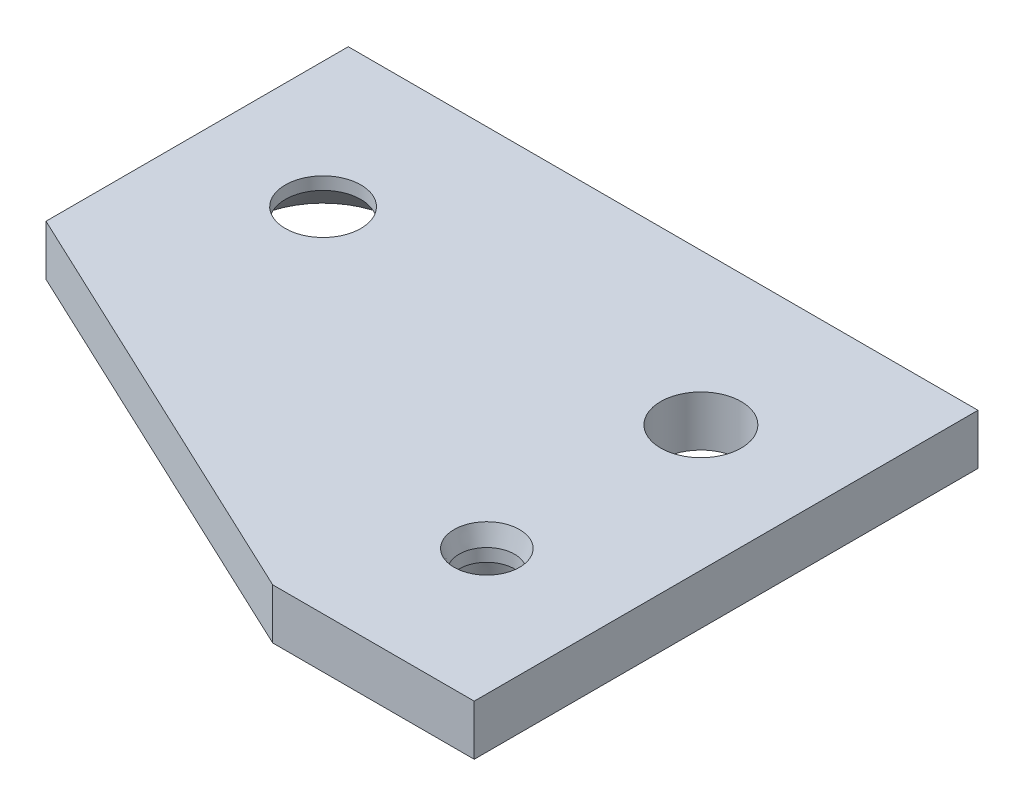
ISO-10303-21;
HEADER;
FILE_DESCRIPTION(('STEP AP214'),'2;1');
FILE_NAME('part.step','',(''),(''),'','','');
FILE_SCHEMA(('AUTOMOTIVE_DESIGN { 1 0 10303 214 1 1 1 1 }'));
ENDSEC;
DATA;
#1=APPLICATION_CONTEXT('core data for automotive mechanical design processes');
#2=APPLICATION_PROTOCOL_DEFINITION('international standard','automotive_design',2000,#1);
#3=PRODUCT_CONTEXT('',#1,'mechanical');
#4=PRODUCT('Part','Part','',(#3));
#5=PRODUCT_RELATED_PRODUCT_CATEGORY('part','',(#4));
#6=PRODUCT_DEFINITION_FORMATION('','',#4);
#7=PRODUCT_DEFINITION_CONTEXT('part definition',#1,'design');
#8=PRODUCT_DEFINITION('design','',#6,#7);
#9=PRODUCT_DEFINITION_SHAPE('','',#8);
#10=(LENGTH_UNIT() NAMED_UNIT(*) SI_UNIT(.MILLI.,.METRE.));
#11=(NAMED_UNIT(*) PLANE_ANGLE_UNIT() SI_UNIT($,.RADIAN.));
#12=(NAMED_UNIT(*) SI_UNIT($,.STERADIAN.) SOLID_ANGLE_UNIT());
#13=UNCERTAINTY_MEASURE_WITH_UNIT(LENGTH_MEASURE(1.E-05),#10,'distance_accuracy_value','');
#14=(GEOMETRIC_REPRESENTATION_CONTEXT(3) GLOBAL_UNCERTAINTY_ASSIGNED_CONTEXT((#13)) GLOBAL_UNIT_ASSIGNED_CONTEXT((#10,
#11,#12)) REPRESENTATION_CONTEXT('',''));
#15=CARTESIAN_POINT('',(0.,0.,0.));
#16=DIRECTION('',(0.,0.,1.));
#17=DIRECTION('',(1.,0.,0.));
#18=AXIS2_PLACEMENT_3D('',#15,#16,#17);
#19=CARTESIAN_POINT('',(-20.,2.,14.));
#20=DIRECTION('',(0.,1.,0.));
#21=DIRECTION('',(0.,0.,1.));
#22=AXIS2_PLACEMENT_3D('',#19,#20,#21);
#23=PLANE('',#22);
#24=CARTESIAN_POINT('',(0.,2.,8.5));
#25=DIRECTION('',(0.,1.,0.));
#26=DIRECTION('',(0.,0.,1.));
#27=AXIS2_PLACEMENT_3D('',#24,#25,#26);
#28=CIRCLE('',#27,1.30000000000001);
#29=CARTESIAN_POINT('',(0.,2.,9.80000000000001));
#30=VERTEX_POINT('',#29);
#31=EDGE_CURVE('E11',#30,#30,#28,.F.);
#32=ORIENTED_EDGE('',*,*,#31,.T.);
#33=EDGE_LOOP('',(#32));
#34=FACE_BOUND('',#33,.T.);
#35=CARTESIAN_POINT('',(-15.,2.,0.));
#36=DIRECTION('',(0.,1.,0.));
#37=DIRECTION('',(0.,0.,1.));
#38=AXIS2_PLACEMENT_3D('',#35,#36,#37);
#39=CIRCLE('',#38,1.5);
#40=CARTESIAN_POINT('',(-15.,2.,1.5));
#41=VERTEX_POINT('',#40);
#42=EDGE_CURVE('E275',#41,#41,#39,.T.);
#43=ORIENTED_EDGE('',*,*,#42,.F.);
#44=EDGE_LOOP('',(#43));
#45=FACE_BOUND('',#44,.T.);
#46=DIRECTION('',(0.,0.,1.));
#47=VECTOR('',#46,1.);
#48=CARTESIAN_POINT('',(-20.,2.,-6.));
#49=LINE('',#48,#47);
#50=CARTESIAN_POINT('',(-20.,2.,-6.));
#51=VERTEX_POINT('',#50);
#52=CARTESIAN_POINT('',(-20.,2.,6.));
#53=VERTEX_POINT('',#52);
#54=EDGE_CURVE('E113',#51,#53,#49,.T.);
#55=ORIENTED_EDGE('',*,*,#54,.T.);
#56=DIRECTION('',(0.904818702200994,0.,0.425797036329879));
#57=VECTOR('',#56,1.);
#58=CARTESIAN_POINT('',(-3.,2.,14.));
#59=LINE('',#58,#57);
#60=CARTESIAN_POINT('',(-3.,2.,14.));
#61=VERTEX_POINT('',#60);
#62=EDGE_CURVE('E93',#53,#61,#59,.T.);
#63=ORIENTED_EDGE('',*,*,#62,.T.);
#64=DIRECTION('',(1.,0.,0.));
#65=VECTOR('',#64,1.);
#66=CARTESIAN_POINT('',(-3.,2.,14.));
#67=LINE('',#66,#65);
#68=CARTESIAN_POINT('',(5.,2.,14.));
#69=VERTEX_POINT('',#68);
#70=EDGE_CURVE('E116',#61,#69,#67,.T.);
#71=ORIENTED_EDGE('',*,*,#70,.T.);
#72=DIRECTION('',(0.,0.,-1.));
#73=VECTOR('',#72,1.);
#74=CARTESIAN_POINT('',(5.,2.,-6.));
#75=LINE('',#74,#73);
#76=CARTESIAN_POINT('',(5.,2.,-6.));
#77=VERTEX_POINT('',#76);
#78=EDGE_CURVE('E50',#69,#77,#75,.T.);
#79=ORIENTED_EDGE('',*,*,#78,.T.);
#80=DIRECTION('',(-1.,0.,0.));
#81=VECTOR('',#80,1.);
#82=CARTESIAN_POINT('',(-20.,2.,-6.));
#83=LINE('',#82,#81);
#84=EDGE_CURVE('E45',#77,#51,#83,.T.);
#85=ORIENTED_EDGE('',*,*,#84,.T.);
#86=EDGE_LOOP('',(#55,#63,#71,#79,#85));
#87=FACE_BOUND('',#86,.T.);
#88=CARTESIAN_POINT('',(0.,2.,0.));
#89=DIRECTION('',(0.,1.,0.));
#90=DIRECTION('',(0.,0.,1.));
#91=AXIS2_PLACEMENT_3D('',#88,#89,#90);
#92=CIRCLE('',#91,1.6);
#93=CARTESIAN_POINT('',(0.,2.,1.6));
#94=VERTEX_POINT('',#93);
#95=EDGE_CURVE('E101',#94,#94,#92,.T.);
#96=ORIENTED_EDGE('',*,*,#95,.F.);
#97=EDGE_LOOP('',(#96));
#98=FACE_BOUND('',#97,.T.);
#99=ADVANCED_FACE('F30',(#34,#45,#87,#98),#23,.T.);
#100=CARTESIAN_POINT('',(-20.,0.,14.));
#101=DIRECTION('',(0.,1.,0.));
#102=DIRECTION('',(0.,0.,1.));
#103=AXIS2_PLACEMENT_3D('',#100,#101,#102);
#104=PLANE('',#103);
#105=CARTESIAN_POINT('',(0.,0.,8.5));
#106=DIRECTION('',(0.,1.,0.));
#107=DIRECTION('',(0.,0.,1.));
#108=AXIS2_PLACEMENT_3D('',#105,#106,#107);
#109=CIRCLE('',#108,1.3);
#110=CARTESIAN_POINT('',(0.,0.,9.8));
#111=VERTEX_POINT('',#110);
#112=EDGE_CURVE('E133',#111,#111,#109,.T.);
#113=ORIENTED_EDGE('',*,*,#112,.T.);
#114=EDGE_LOOP('',(#113));
#115=FACE_BOUND('',#114,.T.);
#116=CARTESIAN_POINT('',(-15.,0.,0.));
#117=DIRECTION('',(0.,1.,0.));
#118=DIRECTION('',(0.,0.,1.));
#119=AXIS2_PLACEMENT_3D('',#116,#117,#118);
#120=CIRCLE('',#119,3.);
#121=CARTESIAN_POINT('',(-15.,0.,3.));
#122=VERTEX_POINT('',#121);
#123=EDGE_CURVE('E96',#122,#122,#120,.T.);
#124=ORIENTED_EDGE('',*,*,#123,.T.);
#125=EDGE_LOOP('',(#124));
#126=FACE_BOUND('',#125,.T.);
#127=DIRECTION('',(0.,0.,1.));
#128=VECTOR('',#127,1.);
#129=CARTESIAN_POINT('',(-20.,0.,-6.));
#130=LINE('',#129,#128);
#131=CARTESIAN_POINT('',(-20.,0.,-6.));
#132=VERTEX_POINT('',#131);
#133=CARTESIAN_POINT('',(-20.,0.,6.));
#134=VERTEX_POINT('',#133);
#135=EDGE_CURVE('E83',#132,#134,#130,.T.);
#136=ORIENTED_EDGE('',*,*,#135,.F.);
#137=DIRECTION('',(-1.,0.,0.));
#138=VECTOR('',#137,1.);
#139=CARTESIAN_POINT('',(-20.,0.,-6.));
#140=LINE('',#139,#138);
#141=CARTESIAN_POINT('',(5.,0.,-6.));
#142=VERTEX_POINT('',#141);
#143=EDGE_CURVE('E111',#142,#132,#140,.T.);
#144=ORIENTED_EDGE('',*,*,#143,.F.);
#145=DIRECTION('',(0.,0.,-1.));
#146=VECTOR('',#145,1.);
#147=CARTESIAN_POINT('',(5.,0.,-6.));
#148=LINE('',#147,#146);
#149=CARTESIAN_POINT('',(5.,0.,14.));
#150=VERTEX_POINT('',#149);
#151=EDGE_CURVE('E109',#150,#142,#148,.T.);
#152=ORIENTED_EDGE('',*,*,#151,.F.);
#153=DIRECTION('',(1.,0.,0.));
#154=VECTOR('',#153,1.);
#155=CARTESIAN_POINT('',(-3.,0.,14.));
#156=LINE('',#155,#154);
#157=CARTESIAN_POINT('',(-3.,0.,14.));
#158=VERTEX_POINT('',#157);
#159=EDGE_CURVE('E85',#158,#150,#156,.T.);
#160=ORIENTED_EDGE('',*,*,#159,.F.);
#161=DIRECTION('',(0.904818702200994,0.,0.425797036329879));
#162=VECTOR('',#161,1.);
#163=CARTESIAN_POINT('',(-3.,0.,14.));
#164=LINE('',#163,#162);
#165=EDGE_CURVE('E77',#134,#158,#164,.T.);
#166=ORIENTED_EDGE('',*,*,#165,.F.);
#167=EDGE_LOOP('',(#136,#144,#152,#160,#166));
#168=FACE_BOUND('',#167,.T.);
#169=CARTESIAN_POINT('',(0.,0.,0.));
#170=DIRECTION('',(0.,1.,0.));
#171=DIRECTION('',(0.,0.,1.));
#172=AXIS2_PLACEMENT_3D('',#169,#170,#171);
#173=CIRCLE('',#172,1.6);
#174=CARTESIAN_POINT('',(0.,0.,1.6));
#175=VERTEX_POINT('',#174);
#176=EDGE_CURVE('E104',#175,#175,#173,.T.);
#177=ORIENTED_EDGE('',*,*,#176,.T.);
#178=EDGE_LOOP('',(#177));
#179=FACE_BOUND('',#178,.T.);
#180=ADVANCED_FACE('F79',(#115,#126,#168,#179),#104,.F.);
#181=CARTESIAN_POINT('',(-20.,2.,-6.));
#182=DIRECTION('',(1.,0.,0.));
#183=DIRECTION('',(0.,0.,-1.));
#184=AXIS2_PLACEMENT_3D('',#181,#182,#183);
#185=PLANE('',#184);
#186=ORIENTED_EDGE('',*,*,#135,.T.);
#187=DIRECTION('',(0.,-1.,0.));
#188=VECTOR('',#187,1.);
#189=CARTESIAN_POINT('',(-20.,2.,6.));
#190=LINE('',#189,#188);
#191=EDGE_CURVE('E91',#53,#134,#190,.T.);
#192=ORIENTED_EDGE('',*,*,#191,.F.);
#193=ORIENTED_EDGE('',*,*,#54,.F.);
#194=DIRECTION('',(0.,-1.,0.));
#195=VECTOR('',#194,1.);
#196=CARTESIAN_POINT('',(-20.,2.,-6.));
#197=LINE('',#196,#195);
#198=EDGE_CURVE('E100',#51,#132,#197,.T.);
#199=ORIENTED_EDGE('',*,*,#198,.T.);
#200=EDGE_LOOP('',(#186,#192,#193,#199));
#201=FACE_BOUND('',#200,.T.);
#202=ADVANCED_FACE('F32',(#201),#185,.F.);
#203=CARTESIAN_POINT('',(-3.,2.,14.));
#204=DIRECTION('',(0.425797036329879,0.,-0.904818702200994));
#205=DIRECTION('',(-0.904818702200994,0.,-0.425797036329879));
#206=AXIS2_PLACEMENT_3D('',#203,#204,#205);
#207=PLANE('',#206);
#208=ORIENTED_EDGE('',*,*,#165,.T.);
#209=DIRECTION('',(0.,-1.,0.));
#210=VECTOR('',#209,1.);
#211=CARTESIAN_POINT('',(-3.,2.,14.));
#212=LINE('',#211,#210);
#213=EDGE_CURVE('E97',#61,#158,#212,.T.);
#214=ORIENTED_EDGE('',*,*,#213,.F.);
#215=ORIENTED_EDGE('',*,*,#62,.F.);
#216=ORIENTED_EDGE('',*,*,#191,.T.);
#217=EDGE_LOOP('',(#208,#214,#215,#216));
#218=FACE_BOUND('',#217,.T.);
#219=ADVANCED_FACE('F92',(#218),#207,.F.);
#220=CARTESIAN_POINT('',(-3.,2.,14.));
#221=DIRECTION('',(0.,0.,-1.));
#222=DIRECTION('',(-1.,0.,0.));
#223=AXIS2_PLACEMENT_3D('',#220,#221,#222);
#224=PLANE('',#223);
#225=ORIENTED_EDGE('',*,*,#159,.T.);
#226=DIRECTION('',(0.,-1.,0.));
#227=VECTOR('',#226,1.);
#228=CARTESIAN_POINT('',(5.,2.,14.));
#229=LINE('',#228,#227);
#230=EDGE_CURVE('E124',#69,#150,#229,.T.);
#231=ORIENTED_EDGE('',*,*,#230,.F.);
#232=ORIENTED_EDGE('',*,*,#70,.F.);
#233=ORIENTED_EDGE('',*,*,#213,.T.);
#234=EDGE_LOOP('',(#225,#231,#232,#233));
#235=FACE_BOUND('',#234,.T.);
#236=ADVANCED_FACE('F182',(#235),#224,.F.);
#237=CARTESIAN_POINT('',(5.,2.,-6.));
#238=DIRECTION('',(-1.,0.,0.));
#239=DIRECTION('',(0.,0.,1.));
#240=AXIS2_PLACEMENT_3D('',#237,#238,#239);
#241=PLANE('',#240);
#242=ORIENTED_EDGE('',*,*,#151,.T.);
#243=DIRECTION('',(0.,-1.,0.));
#244=VECTOR('',#243,1.);
#245=CARTESIAN_POINT('',(5.,2.,-6.));
#246=LINE('',#245,#244);
#247=EDGE_CURVE('E121',#77,#142,#246,.T.);
#248=ORIENTED_EDGE('',*,*,#247,.F.);
#249=ORIENTED_EDGE('',*,*,#78,.F.);
#250=ORIENTED_EDGE('',*,*,#230,.T.);
#251=EDGE_LOOP('',(#242,#248,#249,#250));
#252=FACE_BOUND('',#251,.T.);
#253=ADVANCED_FACE('F178',(#252),#241,.F.);
#254=CARTESIAN_POINT('',(-20.,2.,-6.));
#255=DIRECTION('',(0.,0.,1.));
#256=DIRECTION('',(1.,0.,0.));
#257=AXIS2_PLACEMENT_3D('',#254,#255,#256);
#258=PLANE('',#257);
#259=ORIENTED_EDGE('',*,*,#143,.T.);
#260=ORIENTED_EDGE('',*,*,#198,.F.);
#261=ORIENTED_EDGE('',*,*,#84,.F.);
#262=ORIENTED_EDGE('',*,*,#247,.T.);
#263=EDGE_LOOP('',(#259,#260,#261,#262));
#264=FACE_BOUND('',#263,.T.);
#265=ADVANCED_FACE('F174',(#264),#258,.F.);
#266=CARTESIAN_POINT('',(0.,2.,0.));
#267=DIRECTION('',(0.,-1.,0.));
#268=DIRECTION('',(0.,0.,-1.));
#269=AXIS2_PLACEMENT_3D('',#266,#267,#268);
#270=CYLINDRICAL_SURFACE('',#269,1.6);
#271=ORIENTED_EDGE('',*,*,#95,.T.);
#272=EDGE_LOOP('',(#271));
#273=FACE_BOUND('',#272,.T.);
#274=ORIENTED_EDGE('',*,*,#176,.F.);
#275=EDGE_LOOP('',(#274));
#276=FACE_BOUND('',#275,.T.);
#277=ADVANCED_FACE('F177',(#273,#276),#270,.F.);
#278=CARTESIAN_POINT('',(-15.,2.,0.));
#279=DIRECTION('',(0.,-1.,0.));
#280=DIRECTION('',(0.,0.,-1.));
#281=AXIS2_PLACEMENT_3D('',#278,#279,#280);
#282=CYLINDRICAL_SURFACE('',#281,1.5);
#283=CARTESIAN_POINT('',(-15.,1.50000000000001,0.));
#284=DIRECTION('',(0.,1.,0.));
#285=DIRECTION('',(0.,0.,1.));
#286=AXIS2_PLACEMENT_3D('',#283,#284,#285);
#287=CIRCLE('',#286,1.5);
#288=CARTESIAN_POINT('',(-15.,1.50000000000001,1.5));
#289=VERTEX_POINT('',#288);
#290=EDGE_CURVE('E130',#289,#289,#287,.F.);
#291=ORIENTED_EDGE('',*,*,#290,.T.);
#292=EDGE_LOOP('',(#291));
#293=FACE_BOUND('',#292,.T.);
#294=ORIENTED_EDGE('',*,*,#42,.T.);
#295=EDGE_LOOP('',(#294));
#296=FACE_BOUND('',#295,.T.);
#297=ADVANCED_FACE('F163',(#293,#296),#282,.F.);
#298=CARTESIAN_POINT('',(0.,2.,8.5));
#299=DIRECTION('',(0.,-1.,0.));
#300=DIRECTION('',(0.,0.,-1.));
#301=AXIS2_PLACEMENT_3D('',#298,#299,#300);
#302=CYLINDRICAL_SURFACE('',#301,1.1);
#303=CARTESIAN_POINT('',(0.,0.746410161513759,8.5));
#304=DIRECTION('',(0.,1.,0.));
#305=DIRECTION('',(0.,0.,1.));
#306=AXIS2_PLACEMENT_3D('',#303,#304,#305);
#307=CIRCLE('',#306,1.1);
#308=CARTESIAN_POINT('',(0.,0.746410161513759,9.6));
#309=VERTEX_POINT('',#308);
#310=EDGE_CURVE('E38',#309,#309,#307,.F.);
#311=ORIENTED_EDGE('',*,*,#310,.T.);
#312=EDGE_LOOP('',(#311));
#313=FACE_BOUND('',#312,.T.);
#314=CARTESIAN_POINT('',(0.,1.2535898384862,8.5));
#315=DIRECTION('',(0.,1.,0.));
#316=DIRECTION('',(0.,0.,1.));
#317=AXIS2_PLACEMENT_3D('',#314,#315,#316);
#318=CIRCLE('',#317,1.1);
#319=CARTESIAN_POINT('',(0.,1.2535898384862,9.6));
#320=VERTEX_POINT('',#319);
#321=EDGE_CURVE('E136',#320,#320,#318,.T.);
#322=ORIENTED_EDGE('',*,*,#321,.T.);
#323=EDGE_LOOP('',(#322));
#324=FACE_BOUND('',#323,.T.);
#325=ADVANCED_FACE('F141',(#313,#324),#302,.F.);
#326=CARTESIAN_POINT('',(-15.,0.,0.));
#327=DIRECTION('',(0.,-1.,0.));
#328=DIRECTION('',(0.,0.,-1.));
#329=AXIS2_PLACEMENT_3D('',#326,#327,#328);
#330=CONICAL_SURFACE('',#329,3.,0.785398163397447);
#331=ORIENTED_EDGE('',*,*,#290,.F.);
#332=EDGE_LOOP('',(#331));
#333=FACE_BOUND('',#332,.T.);
#334=ORIENTED_EDGE('',*,*,#123,.F.);
#335=EDGE_LOOP('',(#334));
#336=FACE_BOUND('',#335,.T.);
#337=ADVANCED_FACE('F148',(#333,#336),#330,.F.);
#338=CARTESIAN_POINT('',(0.,0.,8.5));
#339=DIRECTION('',(0.,-1.,0.));
#340=DIRECTION('',(0.,0.,-1.));
#341=AXIS2_PLACEMENT_3D('',#338,#339,#340);
#342=CONICAL_SURFACE('',#341,1.3,0.26179938779915);
#343=ORIENTED_EDGE('',*,*,#310,.F.);
#344=EDGE_LOOP('',(#343));
#345=FACE_BOUND('',#344,.T.);
#346=ORIENTED_EDGE('',*,*,#112,.F.);
#347=EDGE_LOOP('',(#346));
#348=FACE_BOUND('',#347,.T.);
#349=ADVANCED_FACE('F144',(#345,#348),#342,.F.);
#350=CARTESIAN_POINT('',(0.,1.2535898384862,8.5));
#351=DIRECTION('',(0.,1.,0.));
#352=DIRECTION('',(0.,0.,1.));
#353=AXIS2_PLACEMENT_3D('',#350,#351,#352);
#354=CONICAL_SURFACE('',#353,1.1,0.261799387799153);
#355=ORIENTED_EDGE('',*,*,#31,.F.);
#356=EDGE_LOOP('',(#355));
#357=FACE_BOUND('',#356,.T.);
#358=ORIENTED_EDGE('',*,*,#321,.F.);
#359=EDGE_LOOP('',(#358));
#360=FACE_BOUND('',#359,.T.);
#361=ADVANCED_FACE('F147',(#357,#360),#354,.F.);
#362=CLOSED_SHELL('',(#99,#180,#202,#219,#236,#253,#265,#277,#297,#325,#337,#349,#361));
#363=MANIFOLD_SOLID_BREP('B2',#362);
#364=ADVANCED_BREP_SHAPE_REPRESENTATION('',(#18,#363),#14);
#365=SHAPE_DEFINITION_REPRESENTATION(#9,#364);
ENDSEC;
END-ISO-10303-21;
